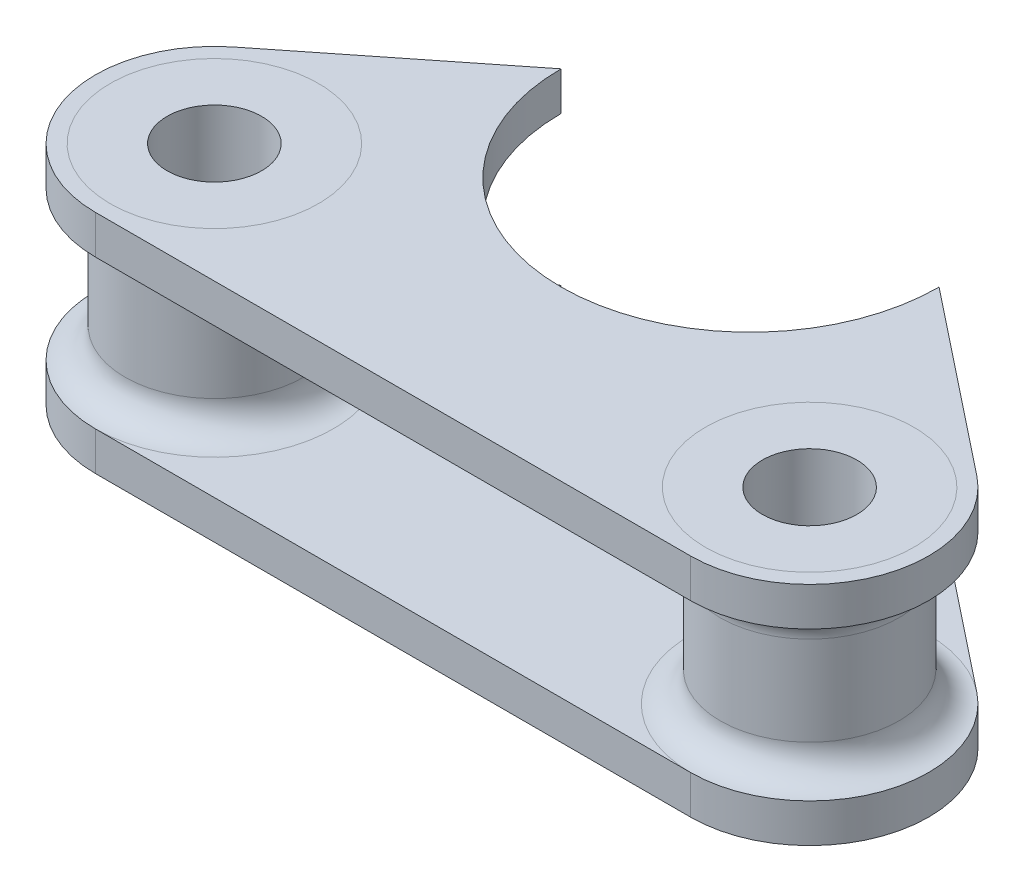
ISO-10303-21;
HEADER;
FILE_DESCRIPTION(('STEP AP214'),'2;1');
FILE_NAME('part.step','',(''),(''),'','','');
FILE_SCHEMA(('AUTOMOTIVE_DESIGN { 1 0 10303 214 1 1 1 1 }'));
ENDSEC;
DATA;
#1=APPLICATION_CONTEXT('core data for automotive mechanical design processes');
#2=APPLICATION_PROTOCOL_DEFINITION('international standard','automotive_design',2000,#1);
#3=PRODUCT_CONTEXT('',#1,'mechanical');
#4=PRODUCT('Part','Part','',(#3));
#5=PRODUCT_RELATED_PRODUCT_CATEGORY('part','',(#4));
#6=PRODUCT_DEFINITION_FORMATION('','',#4);
#7=PRODUCT_DEFINITION_CONTEXT('part definition',#1,'design');
#8=PRODUCT_DEFINITION('design','',#6,#7);
#9=PRODUCT_DEFINITION_SHAPE('','',#8);
#10=(LENGTH_UNIT() NAMED_UNIT(*) SI_UNIT(.MILLI.,.METRE.));
#11=(NAMED_UNIT(*) PLANE_ANGLE_UNIT() SI_UNIT($,.RADIAN.));
#12=(NAMED_UNIT(*) SI_UNIT($,.STERADIAN.) SOLID_ANGLE_UNIT());
#13=UNCERTAINTY_MEASURE_WITH_UNIT(LENGTH_MEASURE(1.E-05),#10,'distance_accuracy_value','');
#14=(GEOMETRIC_REPRESENTATION_CONTEXT(3) GLOBAL_UNCERTAINTY_ASSIGNED_CONTEXT((#13)) GLOBAL_UNIT_ASSIGNED_CONTEXT((#10,
#11,#12)) REPRESENTATION_CONTEXT('',''));
#15=CARTESIAN_POINT('',(0.,0.,0.));
#16=DIRECTION('',(0.,0.,1.));
#17=DIRECTION('',(1.,0.,0.));
#18=AXIS2_PLACEMENT_3D('',#15,#16,#17);
#19=CARTESIAN_POINT('',(0.,-7.6,-16.));
#20=DIRECTION('',(0.,1.,0.));
#21=DIRECTION('',(0.,0.,1.));
#22=AXIS2_PLACEMENT_3D('',#19,#20,#21);
#23=PLANE('',#22);
#24=CARTESIAN_POINT('',(-20.,-7.6,0.));
#25=DIRECTION('',(0.,1.,0.));
#26=DIRECTION('',(0.,0.,1.));
#27=AXIS2_PLACEMENT_3D('',#24,#25,#26);
#28=CIRCLE('',#27,7.);
#29=CARTESIAN_POINT('',(-20.,-7.6,7.));
#30=VERTEX_POINT('',#29);
#31=EDGE_CURVE('E160',#30,#30,#28,.F.);
#32=ORIENTED_EDGE('',*,*,#31,.F.);
#33=EDGE_LOOP('',(#32));
#34=FACE_BOUND('',#33,.T.);
#35=CARTESIAN_POINT('',(0.,-7.6,-16.));
#36=DIRECTION('',(0.,-1.,0.));
#37=DIRECTION('',(0.,0.,1.));
#38=AXIS2_PLACEMENT_3D('',#35,#36,#37);
#39=CIRCLE('',#38,12.7);
#40=CARTESIAN_POINT('',(12.7,-7.6,-16.));
#41=VERTEX_POINT('',#40);
#42=CARTESIAN_POINT('',(-12.7,-7.6,-16.));
#43=VERTEX_POINT('',#42);
#44=EDGE_CURVE('E245',#41,#43,#39,.T.);
#45=ORIENTED_EDGE('',*,*,#44,.F.);
#46=DIRECTION('',(-0.7835063491706,0.,-0.621383779004053));
#47=VECTOR('',#46,1.);
#48=CARTESIAN_POINT('',(12.7,-7.6,-16.));
#49=LINE('',#48,#47);
#50=CARTESIAN_POINT('',(24.9710702320324,-7.6,-6.26805079336479));
#51=VERTEX_POINT('',#50);
#52=EDGE_CURVE('E258',#51,#41,#49,.T.);
#53=ORIENTED_EDGE('',*,*,#52,.F.);
#54=CARTESIAN_POINT('',(20.,-7.6,0.));
#55=DIRECTION('',(0.,1.,0.));
#56=DIRECTION('',(0.,0.,1.));
#57=AXIS2_PLACEMENT_3D('',#54,#55,#56);
#58=CIRCLE('',#57,8.);
#59=CARTESIAN_POINT('',(20.,-7.6,8.));
#60=VERTEX_POINT('',#59);
#61=EDGE_CURVE('E255',#60,#51,#58,.T.);
#62=ORIENTED_EDGE('',*,*,#61,.F.);
#63=DIRECTION('',(1.,0.,0.));
#64=VECTOR('',#63,1.);
#65=CARTESIAN_POINT('',(-20.,-7.6,8.));
#66=LINE('',#65,#64);
#67=CARTESIAN_POINT('',(-20.,-7.6,8.));
#68=VERTEX_POINT('',#67);
#69=EDGE_CURVE('E252',#68,#60,#66,.T.);
#70=ORIENTED_EDGE('',*,*,#69,.F.);
#71=CARTESIAN_POINT('',(-20.,-7.6,0.));
#72=DIRECTION('',(0.,1.,0.));
#73=DIRECTION('',(0.,0.,1.));
#74=AXIS2_PLACEMENT_3D('',#71,#72,#73);
#75=CIRCLE('',#74,8.);
#76=CARTESIAN_POINT('',(-24.9710702320324,-7.6,-6.2680507933648));
#77=VERTEX_POINT('',#76);
#78=EDGE_CURVE('E250',#77,#68,#75,.T.);
#79=ORIENTED_EDGE('',*,*,#78,.F.);
#80=DIRECTION('',(-0.7835063491706,0.,0.621383779004054));
#81=VECTOR('',#80,1.);
#82=CARTESIAN_POINT('',(-12.7,-7.6,-16.));
#83=LINE('',#82,#81);
#84=EDGE_CURVE('E224',#43,#77,#83,.T.);
#85=ORIENTED_EDGE('',*,*,#84,.F.);
#86=EDGE_LOOP('',(#45,#53,#62,#70,#79,#85));
#87=FACE_BOUND('',#86,.T.);
#88=CARTESIAN_POINT('',(20.,-7.6,0.));
#89=DIRECTION('',(0.,1.,0.));
#90=DIRECTION('',(0.,0.,1.));
#91=AXIS2_PLACEMENT_3D('',#88,#89,#90);
#92=CIRCLE('',#91,7.);
#93=CARTESIAN_POINT('',(20.,-7.6,7.));
#94=VERTEX_POINT('',#93);
#95=EDGE_CURVE('E168',#94,#94,#92,.F.);
#96=ORIENTED_EDGE('',*,*,#95,.F.);
#97=EDGE_LOOP('',(#96));
#98=FACE_BOUND('',#97,.T.);
#99=ADVANCED_FACE('F38',(#34,#87,#98),#23,.F.);
#100=CARTESIAN_POINT('',(0.,7.6,-16.));
#101=DIRECTION('',(0.,1.,0.));
#102=DIRECTION('',(0.,0.,1.));
#103=AXIS2_PLACEMENT_3D('',#100,#101,#102);
#104=PLANE('',#103);
#105=CARTESIAN_POINT('',(-20.,7.6,0.));
#106=DIRECTION('',(0.,1.,0.));
#107=DIRECTION('',(0.,0.,1.));
#108=AXIS2_PLACEMENT_3D('',#105,#106,#107);
#109=CIRCLE('',#108,7.);
#110=CARTESIAN_POINT('',(-20.,7.6,7.));
#111=VERTEX_POINT('',#110);
#112=EDGE_CURVE('E154',#111,#111,#109,.F.);
#113=ORIENTED_EDGE('',*,*,#112,.T.);
#114=EDGE_LOOP('',(#113));
#115=FACE_BOUND('',#114,.T.);
#116=CARTESIAN_POINT('',(0.,7.6,-16.));
#117=DIRECTION('',(0.,-1.,0.));
#118=DIRECTION('',(0.,0.,1.));
#119=AXIS2_PLACEMENT_3D('',#116,#117,#118);
#120=CIRCLE('',#119,12.7);
#121=CARTESIAN_POINT('',(12.7,7.6,-16.));
#122=VERTEX_POINT('',#121);
#123=CARTESIAN_POINT('',(-12.7,7.6,-16.));
#124=VERTEX_POINT('',#123);
#125=EDGE_CURVE('E136',#122,#124,#120,.T.);
#126=ORIENTED_EDGE('',*,*,#125,.T.);
#127=DIRECTION('',(-0.7835063491706,0.,0.621383779004054));
#128=VECTOR('',#127,1.);
#129=CARTESIAN_POINT('',(-12.7,7.6,-16.));
#130=LINE('',#129,#128);
#131=CARTESIAN_POINT('',(-24.9710702320324,7.6,-6.2680507933648));
#132=VERTEX_POINT('',#131);
#133=EDGE_CURVE('E139',#124,#132,#130,.T.);
#134=ORIENTED_EDGE('',*,*,#133,.T.);
#135=CARTESIAN_POINT('',(-20.,7.6,0.));
#136=DIRECTION('',(0.,1.,0.));
#137=DIRECTION('',(0.,0.,1.));
#138=AXIS2_PLACEMENT_3D('',#135,#136,#137);
#139=CIRCLE('',#138,8.);
#140=CARTESIAN_POINT('',(-20.,7.6,8.));
#141=VERTEX_POINT('',#140);
#142=EDGE_CURVE('E143',#132,#141,#139,.T.);
#143=ORIENTED_EDGE('',*,*,#142,.T.);
#144=DIRECTION('',(1.,0.,0.));
#145=VECTOR('',#144,1.);
#146=CARTESIAN_POINT('',(-20.,7.6,8.));
#147=LINE('',#146,#145);
#148=CARTESIAN_POINT('',(20.,7.6,8.));
#149=VERTEX_POINT('',#148);
#150=EDGE_CURVE('E146',#141,#149,#147,.T.);
#151=ORIENTED_EDGE('',*,*,#150,.T.);
#152=CARTESIAN_POINT('',(20.,7.6,0.));
#153=DIRECTION('',(0.,1.,0.));
#154=DIRECTION('',(0.,0.,1.));
#155=AXIS2_PLACEMENT_3D('',#152,#153,#154);
#156=CIRCLE('',#155,8.);
#157=CARTESIAN_POINT('',(24.9710702320324,7.6,-6.26805079336479));
#158=VERTEX_POINT('',#157);
#159=EDGE_CURVE('E122',#149,#158,#156,.T.);
#160=ORIENTED_EDGE('',*,*,#159,.T.);
#161=DIRECTION('',(-0.7835063491706,0.,-0.621383779004053));
#162=VECTOR('',#161,1.);
#163=CARTESIAN_POINT('',(12.7,7.6,-16.));
#164=LINE('',#163,#162);
#165=EDGE_CURVE('E149',#158,#122,#164,.T.);
#166=ORIENTED_EDGE('',*,*,#165,.T.);
#167=EDGE_LOOP('',(#126,#134,#143,#151,#160,#166));
#168=FACE_BOUND('',#167,.T.);
#169=CARTESIAN_POINT('',(20.,7.6,0.));
#170=DIRECTION('',(0.,1.,0.));
#171=DIRECTION('',(0.,0.,1.));
#172=AXIS2_PLACEMENT_3D('',#169,#170,#171);
#173=CIRCLE('',#172,7.);
#174=CARTESIAN_POINT('',(20.,7.6,7.));
#175=VERTEX_POINT('',#174);
#176=EDGE_CURVE('E164',#175,#175,#173,.F.);
#177=ORIENTED_EDGE('',*,*,#176,.T.);
#178=EDGE_LOOP('',(#177));
#179=FACE_BOUND('',#178,.T.);
#180=ADVANCED_FACE('F288',(#115,#168,#179),#104,.T.);
#181=ORIENTED_EDGE('',*,*,#95,.T.);
#182=EDGE_LOOP('',(#181));
#183=FACE_BOUND('',#182,.T.);
#184=CARTESIAN_POINT('',(20.,-7.6,0.));
#185=DIRECTION('',(0.,1.,0.));
#186=DIRECTION('',(0.,0.,1.));
#187=AXIS2_PLACEMENT_3D('',#184,#185,#186);
#188=CIRCLE('',#187,3.175);
#189=CARTESIAN_POINT('',(20.,-7.6,3.175));
#190=VERTEX_POINT('',#189);
#191=EDGE_CURVE('E332',#190,#190,#188,.T.);
#192=ORIENTED_EDGE('',*,*,#191,.T.);
#193=EDGE_LOOP('',(#192));
#194=FACE_BOUND('',#193,.T.);
#195=ADVANCED_FACE('F304',(#183,#194),#23,.F.);
#196=ORIENTED_EDGE('',*,*,#176,.F.);
#197=EDGE_LOOP('',(#196));
#198=FACE_BOUND('',#197,.T.);
#199=CARTESIAN_POINT('',(20.,7.6,0.));
#200=DIRECTION('',(0.,1.,0.));
#201=DIRECTION('',(0.,0.,1.));
#202=AXIS2_PLACEMENT_3D('',#199,#200,#201);
#203=CIRCLE('',#202,3.175);
#204=CARTESIAN_POINT('',(20.,7.6,3.175));
#205=VERTEX_POINT('',#204);
#206=EDGE_CURVE('E271',#205,#205,#203,.T.);
#207=ORIENTED_EDGE('',*,*,#206,.F.);
#208=EDGE_LOOP('',(#207));
#209=FACE_BOUND('',#208,.T.);
#210=ADVANCED_FACE('F310',(#198,#209),#104,.T.);
#211=CARTESIAN_POINT('',(-20.,-6.,0.));
#212=DIRECTION('',(0.,1.,0.));
#213=DIRECTION('',(0.,0.,1.));
#214=AXIS2_PLACEMENT_3D('',#211,#212,#213);
#215=CYLINDRICAL_SURFACE('',#214,6.);
#216=CARTESIAN_POINT('',(-20.,3.,0.));
#217=DIRECTION('',(0.,1.,0.));
#218=DIRECTION('',(0.,0.,1.));
#219=AXIS2_PLACEMENT_3D('',#216,#217,#218);
#220=CIRCLE('',#219,6.);
#221=CARTESIAN_POINT('',(-20.,3.,6.));
#222=VERTEX_POINT('',#221);
#223=EDGE_CURVE('E11',#222,#222,#220,.F.);
#224=ORIENTED_EDGE('',*,*,#223,.T.);
#225=EDGE_LOOP('',(#224));
#226=FACE_BOUND('',#225,.T.);
#227=CARTESIAN_POINT('',(-20.,-3.,0.));
#228=DIRECTION('',(0.,1.,0.));
#229=DIRECTION('',(0.,0.,1.));
#230=AXIS2_PLACEMENT_3D('',#227,#228,#229);
#231=CIRCLE('',#230,6.);
#232=CARTESIAN_POINT('',(-20.,-3.,6.));
#233=VERTEX_POINT('',#232);
#234=EDGE_CURVE('E47',#233,#233,#231,.T.);
#235=ORIENTED_EDGE('',*,*,#234,.T.);
#236=EDGE_LOOP('',(#235));
#237=FACE_BOUND('',#236,.T.);
#238=ADVANCED_FACE('F189',(#226,#237),#215,.T.);
#239=CARTESIAN_POINT('',(-20.,-6.,0.));
#240=DIRECTION('',(0.,1.,0.));
#241=DIRECTION('',(0.,0.,1.));
#242=AXIS2_PLACEMENT_3D('',#239,#240,#241);
#243=CYLINDRICAL_SURFACE('',#242,3.175);
#244=CARTESIAN_POINT('',(-20.,7.6,0.));
#245=DIRECTION('',(0.,1.,0.));
#246=DIRECTION('',(0.,0.,1.));
#247=AXIS2_PLACEMENT_3D('',#244,#245,#246);
#248=CIRCLE('',#247,3.175);
#249=CARTESIAN_POINT('',(-20.,7.6,3.175));
#250=VERTEX_POINT('',#249);
#251=EDGE_CURVE('E140',#250,#250,#248,.T.);
#252=ORIENTED_EDGE('',*,*,#251,.T.);
#253=EDGE_LOOP('',(#252));
#254=FACE_BOUND('',#253,.T.);
#255=CARTESIAN_POINT('',(-20.,-7.6,0.));
#256=DIRECTION('',(0.,1.,0.));
#257=DIRECTION('',(0.,0.,1.));
#258=AXIS2_PLACEMENT_3D('',#255,#256,#257);
#259=CIRCLE('',#258,3.175);
#260=CARTESIAN_POINT('',(-20.,-7.6,3.175));
#261=VERTEX_POINT('',#260);
#262=EDGE_CURVE('E248',#261,#261,#259,.T.);
#263=ORIENTED_EDGE('',*,*,#262,.F.);
#264=EDGE_LOOP('',(#263));
#265=FACE_BOUND('',#264,.T.);
#266=ADVANCED_FACE('F298',(#254,#265),#243,.F.);
#267=CARTESIAN_POINT('',(0.,5.,-16.));
#268=DIRECTION('',(0.,1.,0.));
#269=DIRECTION('',(0.,0.,1.));
#270=AXIS2_PLACEMENT_3D('',#267,#268,#269);
#271=CYLINDRICAL_SURFACE('',#270,12.7);
#272=ORIENTED_EDGE('',*,*,#125,.F.);
#273=DIRECTION('',(0.,1.,0.));
#274=VECTOR('',#273,1.);
#275=CARTESIAN_POINT('',(12.7,5.,-16.));
#276=LINE('',#275,#274);
#277=CARTESIAN_POINT('',(12.7,5.,-16.));
#278=VERTEX_POINT('',#277);
#279=EDGE_CURVE('E55',#278,#122,#276,.T.);
#280=ORIENTED_EDGE('',*,*,#279,.F.);
#281=CARTESIAN_POINT('',(0.,5.,-16.));
#282=DIRECTION('',(0.,-1.,0.));
#283=DIRECTION('',(0.,0.,1.));
#284=AXIS2_PLACEMENT_3D('',#281,#282,#283);
#285=CIRCLE('',#284,12.7);
#286=CARTESIAN_POINT('',(-12.7,5.,-16.));
#287=VERTEX_POINT('',#286);
#288=EDGE_CURVE('E152',#278,#287,#285,.T.);
#289=ORIENTED_EDGE('',*,*,#288,.T.);
#290=DIRECTION('',(0.,1.,0.));
#291=VECTOR('',#290,1.);
#292=CARTESIAN_POINT('',(-12.7,5.,-16.));
#293=LINE('',#292,#291);
#294=EDGE_CURVE('E92',#287,#124,#293,.T.);
#295=ORIENTED_EDGE('',*,*,#294,.T.);
#296=EDGE_LOOP('',(#272,#280,#289,#295));
#297=FACE_BOUND('',#296,.T.);
#298=ADVANCED_FACE('F285',(#297),#271,.F.);
#299=CARTESIAN_POINT('',(12.7,5.,-16.));
#300=DIRECTION('',(0.621383779004054,0.,-0.7835063491706));
#301=DIRECTION('',(-0.7835063491706,0.,-0.621383779004054));
#302=AXIS2_PLACEMENT_3D('',#299,#300,#301);
#303=PLANE('',#302);
#304=ORIENTED_EDGE('',*,*,#165,.F.);
#305=DIRECTION('',(0.,1.,0.));
#306=VECTOR('',#305,1.);
#307=CARTESIAN_POINT('',(24.9710702320324,5.,-6.26805079336479));
#308=LINE('',#307,#306);
#309=CARTESIAN_POINT('',(24.9710702320324,5.,-6.26805079336479));
#310=VERTEX_POINT('',#309);
#311=EDGE_CURVE('E80',#310,#158,#308,.T.);
#312=ORIENTED_EDGE('',*,*,#311,.F.);
#313=DIRECTION('',(-0.7835063491706,0.,-0.621383779004053));
#314=VECTOR('',#313,1.);
#315=CARTESIAN_POINT('',(12.7,5.,-16.));
#316=LINE('',#315,#314);
#317=EDGE_CURVE('E113',#310,#278,#316,.T.);
#318=ORIENTED_EDGE('',*,*,#317,.T.);
#319=ORIENTED_EDGE('',*,*,#279,.T.);
#320=EDGE_LOOP('',(#304,#312,#318,#319));
#321=FACE_BOUND('',#320,.T.);
#322=ADVANCED_FACE('F290',(#321),#303,.T.);
#323=CARTESIAN_POINT('',(20.,5.,0.));
#324=DIRECTION('',(0.,1.,0.));
#325=DIRECTION('',(0.,0.,1.));
#326=AXIS2_PLACEMENT_3D('',#323,#324,#325);
#327=CYLINDRICAL_SURFACE('',#326,8.);
#328=ORIENTED_EDGE('',*,*,#159,.F.);
#329=DIRECTION('',(0.,1.,0.));
#330=VECTOR('',#329,1.);
#331=CARTESIAN_POINT('',(20.,5.,8.));
#332=LINE('',#331,#330);
#333=CARTESIAN_POINT('',(20.,5.,8.));
#334=VERTEX_POINT('',#333);
#335=EDGE_CURVE('E119',#334,#149,#332,.T.);
#336=ORIENTED_EDGE('',*,*,#335,.F.);
#337=CARTESIAN_POINT('',(20.,5.,0.));
#338=DIRECTION('',(0.,1.,0.));
#339=DIRECTION('',(0.,0.,1.));
#340=AXIS2_PLACEMENT_3D('',#337,#338,#339);
#341=CIRCLE('',#340,8.);
#342=EDGE_CURVE('E121',#334,#310,#341,.T.);
#343=ORIENTED_EDGE('',*,*,#342,.T.);
#344=ORIENTED_EDGE('',*,*,#311,.T.);
#345=EDGE_LOOP('',(#328,#336,#343,#344));
#346=FACE_BOUND('',#345,.T.);
#347=ADVANCED_FACE('F120',(#346),#327,.T.);
#348=CARTESIAN_POINT('',(-20.,5.,8.));
#349=DIRECTION('',(0.,0.,1.));
#350=DIRECTION('',(1.,0.,0.));
#351=AXIS2_PLACEMENT_3D('',#348,#349,#350);
#352=PLANE('',#351);
#353=ORIENTED_EDGE('',*,*,#150,.F.);
#354=DIRECTION('',(0.,1.,0.));
#355=VECTOR('',#354,1.);
#356=CARTESIAN_POINT('',(-20.,5.,8.));
#357=LINE('',#356,#355);
#358=CARTESIAN_POINT('',(-20.,5.,8.));
#359=VERTEX_POINT('',#358);
#360=EDGE_CURVE('E126',#359,#141,#357,.T.);
#361=ORIENTED_EDGE('',*,*,#360,.F.);
#362=DIRECTION('',(1.,0.,0.));
#363=VECTOR('',#362,1.);
#364=CARTESIAN_POINT('',(-20.,5.,8.));
#365=LINE('',#364,#363);
#366=EDGE_CURVE('E111',#359,#334,#365,.T.);
#367=ORIENTED_EDGE('',*,*,#366,.T.);
#368=ORIENTED_EDGE('',*,*,#335,.T.);
#369=EDGE_LOOP('',(#353,#361,#367,#368));
#370=FACE_BOUND('',#369,.T.);
#371=ADVANCED_FACE('F128',(#370),#352,.T.);
#372=CARTESIAN_POINT('',(-20.,5.,0.));
#373=DIRECTION('',(0.,1.,0.));
#374=DIRECTION('',(0.,0.,1.));
#375=AXIS2_PLACEMENT_3D('',#372,#373,#374);
#376=CYLINDRICAL_SURFACE('',#375,8.);
#377=ORIENTED_EDGE('',*,*,#142,.F.);
#378=DIRECTION('',(0.,1.,0.));
#379=VECTOR('',#378,1.);
#380=CARTESIAN_POINT('',(-24.9710702320324,5.,-6.2680507933648));
#381=LINE('',#380,#379);
#382=CARTESIAN_POINT('',(-24.9710702320324,5.,-6.2680507933648));
#383=VERTEX_POINT('',#382);
#384=EDGE_CURVE('E157',#383,#132,#381,.T.);
#385=ORIENTED_EDGE('',*,*,#384,.F.);
#386=CARTESIAN_POINT('',(-20.,5.,0.));
#387=DIRECTION('',(0.,1.,0.));
#388=DIRECTION('',(0.,0.,1.));
#389=AXIS2_PLACEMENT_3D('',#386,#387,#388);
#390=CIRCLE('',#389,8.);
#391=EDGE_CURVE('E129',#383,#359,#390,.T.);
#392=ORIENTED_EDGE('',*,*,#391,.T.);
#393=ORIENTED_EDGE('',*,*,#360,.T.);
#394=EDGE_LOOP('',(#377,#385,#392,#393));
#395=FACE_BOUND('',#394,.T.);
#396=ADVANCED_FACE('F282',(#395),#376,.T.);
#397=CARTESIAN_POINT('',(-12.7,5.,-16.));
#398=DIRECTION('',(-0.621383779004053,0.,-0.7835063491706));
#399=DIRECTION('',(-0.7835063491706,0.,0.621383779004053));
#400=AXIS2_PLACEMENT_3D('',#397,#398,#399);
#401=PLANE('',#400);
#402=ORIENTED_EDGE('',*,*,#133,.F.);
#403=ORIENTED_EDGE('',*,*,#294,.F.);
#404=DIRECTION('',(-0.7835063491706,0.,0.621383779004054));
#405=VECTOR('',#404,1.);
#406=CARTESIAN_POINT('',(-12.7,5.,-16.));
#407=LINE('',#406,#405);
#408=EDGE_CURVE('E277',#287,#383,#407,.T.);
#409=ORIENTED_EDGE('',*,*,#408,.T.);
#410=ORIENTED_EDGE('',*,*,#384,.T.);
#411=EDGE_LOOP('',(#402,#403,#409,#410));
#412=FACE_BOUND('',#411,.T.);
#413=ADVANCED_FACE('F286',(#412),#401,.T.);
#414=CARTESIAN_POINT('',(0.,5.,-16.));
#415=DIRECTION('',(0.,1.,0.));
#416=DIRECTION('',(0.,0.,1.));
#417=AXIS2_PLACEMENT_3D('',#414,#415,#416);
#418=PLANE('',#417);
#419=ORIENTED_EDGE('',*,*,#317,.F.);
#420=CARTESIAN_POINT('',(20.,5.,0.));
#421=DIRECTION('',(0.,1.,0.));
#422=DIRECTION('',(0.,0.,1.));
#423=AXIS2_PLACEMENT_3D('',#420,#421,#422);
#424=CIRCLE('',#423,8.);
#425=EDGE_CURVE('E106',#310,#334,#424,.T.);
#426=ORIENTED_EDGE('',*,*,#425,.T.);
#427=ORIENTED_EDGE('',*,*,#366,.F.);
#428=CARTESIAN_POINT('',(-20.,5.,0.));
#429=DIRECTION('',(0.,1.,0.));
#430=DIRECTION('',(0.,0.,1.));
#431=AXIS2_PLACEMENT_3D('',#428,#429,#430);
#432=CIRCLE('',#431,8.);
#433=EDGE_CURVE('E117',#359,#383,#432,.T.);
#434=ORIENTED_EDGE('',*,*,#433,.T.);
#435=ORIENTED_EDGE('',*,*,#408,.F.);
#436=ORIENTED_EDGE('',*,*,#288,.F.);
#437=EDGE_LOOP('',(#419,#426,#427,#434,#435,#436));
#438=FACE_BOUND('',#437,.T.);
#439=ADVANCED_FACE('F108',(#438),#418,.F.);
#440=ORIENTED_EDGE('',*,*,#112,.F.);
#441=EDGE_LOOP('',(#440));
#442=FACE_BOUND('',#441,.T.);
#443=ORIENTED_EDGE('',*,*,#251,.F.);
#444=EDGE_LOOP('',(#443));
#445=FACE_BOUND('',#444,.T.);
#446=ADVANCED_FACE('F311',(#442,#445),#104,.T.);
#447=CARTESIAN_POINT('',(20.,5.,0.));
#448=DIRECTION('',(0.,1.,0.));
#449=DIRECTION('',(0.,0.,1.));
#450=AXIS2_PLACEMENT_3D('',#447,#448,#449);
#451=CYLINDRICAL_SURFACE('',#450,3.175);
#452=ORIENTED_EDGE('',*,*,#206,.T.);
#453=EDGE_LOOP('',(#452));
#454=FACE_BOUND('',#453,.T.);
#455=ORIENTED_EDGE('',*,*,#191,.F.);
#456=EDGE_LOOP('',(#455));
#457=FACE_BOUND('',#456,.T.);
#458=ADVANCED_FACE('F339',(#454,#457),#451,.F.);
#459=CARTESIAN_POINT('',(20.,-6.,0.));
#460=DIRECTION('',(0.,1.,0.));
#461=DIRECTION('',(0.,0.,1.));
#462=AXIS2_PLACEMENT_3D('',#459,#460,#461);
#463=CYLINDRICAL_SURFACE('',#462,6.);
#464=CARTESIAN_POINT('',(20.,3.,0.));
#465=DIRECTION('',(0.,1.,0.));
#466=DIRECTION('',(0.,0.,1.));
#467=AXIS2_PLACEMENT_3D('',#464,#465,#466);
#468=CIRCLE('',#467,6.);
#469=CARTESIAN_POINT('',(20.,3.,6.));
#470=VERTEX_POINT('',#469);
#471=EDGE_CURVE('E178',#470,#470,#468,.F.);
#472=ORIENTED_EDGE('',*,*,#471,.T.);
#473=EDGE_LOOP('',(#472));
#474=FACE_BOUND('',#473,.T.);
#475=CARTESIAN_POINT('',(20.,-3.,0.));
#476=DIRECTION('',(0.,1.,0.));
#477=DIRECTION('',(0.,0.,1.));
#478=AXIS2_PLACEMENT_3D('',#475,#476,#477);
#479=CIRCLE('',#478,6.);
#480=CARTESIAN_POINT('',(20.,-3.,6.));
#481=VERTEX_POINT('',#480);
#482=EDGE_CURVE('E116',#481,#481,#479,.T.);
#483=ORIENTED_EDGE('',*,*,#482,.T.);
#484=EDGE_LOOP('',(#483));
#485=FACE_BOUND('',#484,.T.);
#486=ADVANCED_FACE('F327',(#474,#485),#463,.T.);
#487=CARTESIAN_POINT('',(0.,-5.,-16.));
#488=DIRECTION('',(0.,1.,0.));
#489=DIRECTION('',(0.,0.,1.));
#490=AXIS2_PLACEMENT_3D('',#487,#488,#489);
#491=PLANE('',#490);
#492=DIRECTION('',(1.,0.,0.));
#493=VECTOR('',#492,1.);
#494=CARTESIAN_POINT('',(-20.,-5.,8.));
#495=LINE('',#494,#493);
#496=CARTESIAN_POINT('',(-20.,-5.,8.));
#497=VERTEX_POINT('',#496);
#498=CARTESIAN_POINT('',(20.,-5.,8.));
#499=VERTEX_POINT('',#498);
#500=EDGE_CURVE('E234',#497,#499,#495,.T.);
#501=ORIENTED_EDGE('',*,*,#500,.T.);
#502=CARTESIAN_POINT('',(20.,-5.,0.));
#503=DIRECTION('',(0.,1.,0.));
#504=DIRECTION('',(0.,0.,1.));
#505=AXIS2_PLACEMENT_3D('',#502,#503,#504);
#506=CIRCLE('',#505,8.);
#507=CARTESIAN_POINT('',(24.9710702320324,-5.,-6.26805079336479));
#508=VERTEX_POINT('',#507);
#509=EDGE_CURVE('E184',#499,#508,#506,.F.);
#510=ORIENTED_EDGE('',*,*,#509,.T.);
#511=DIRECTION('',(-0.7835063491706,0.,-0.621383779004053));
#512=VECTOR('',#511,1.);
#513=CARTESIAN_POINT('',(12.7,-5.,-16.));
#514=LINE('',#513,#512);
#515=CARTESIAN_POINT('',(12.7,-5.,-16.));
#516=VERTEX_POINT('',#515);
#517=EDGE_CURVE('E242',#508,#516,#514,.T.);
#518=ORIENTED_EDGE('',*,*,#517,.T.);
#519=CARTESIAN_POINT('',(0.,-5.,-16.));
#520=DIRECTION('',(0.,-1.,0.));
#521=DIRECTION('',(0.,0.,1.));
#522=AXIS2_PLACEMENT_3D('',#519,#520,#521);
#523=CIRCLE('',#522,12.7);
#524=CARTESIAN_POINT('',(-12.7,-5.,-16.));
#525=VERTEX_POINT('',#524);
#526=EDGE_CURVE('E213',#516,#525,#523,.T.);
#527=ORIENTED_EDGE('',*,*,#526,.T.);
#528=DIRECTION('',(-0.7835063491706,0.,0.621383779004054));
#529=VECTOR('',#528,1.);
#530=CARTESIAN_POINT('',(-12.7,-5.,-16.));
#531=LINE('',#530,#529);
#532=CARTESIAN_POINT('',(-24.9710702320324,-5.,-6.2680507933648));
#533=VERTEX_POINT('',#532);
#534=EDGE_CURVE('E208',#525,#533,#531,.T.);
#535=ORIENTED_EDGE('',*,*,#534,.T.);
#536=CARTESIAN_POINT('',(-20.,-5.,0.));
#537=DIRECTION('',(0.,1.,0.));
#538=DIRECTION('',(0.,0.,1.));
#539=AXIS2_PLACEMENT_3D('',#536,#537,#538);
#540=CIRCLE('',#539,8.);
#541=EDGE_CURVE('E181',#533,#497,#540,.F.);
#542=ORIENTED_EDGE('',*,*,#541,.T.);
#543=EDGE_LOOP('',(#501,#510,#518,#527,#535,#542));
#544=FACE_BOUND('',#543,.T.);
#545=ADVANCED_FACE('F210',(#544),#491,.T.);
#546=ORIENTED_EDGE('',*,*,#31,.T.);
#547=EDGE_LOOP('',(#546));
#548=FACE_BOUND('',#547,.T.);
#549=ORIENTED_EDGE('',*,*,#262,.T.);
#550=EDGE_LOOP('',(#549));
#551=FACE_BOUND('',#550,.T.);
#552=ADVANCED_FACE('F305',(#548,#551),#23,.F.);
#553=CARTESIAN_POINT('',(0.,-5.,-16.));
#554=DIRECTION('',(0.,-1.,0.));
#555=DIRECTION('',(0.,0.,-1.));
#556=AXIS2_PLACEMENT_3D('',#553,#554,#555);
#557=CYLINDRICAL_SURFACE('',#556,12.7);
#558=ORIENTED_EDGE('',*,*,#44,.T.);
#559=DIRECTION('',(0.,-1.,0.));
#560=VECTOR('',#559,1.);
#561=CARTESIAN_POINT('',(-12.7,-5.,-16.));
#562=LINE('',#561,#560);
#563=EDGE_CURVE('E228',#525,#43,#562,.T.);
#564=ORIENTED_EDGE('',*,*,#563,.F.);
#565=ORIENTED_EDGE('',*,*,#526,.F.);
#566=DIRECTION('',(0.,-1.,0.));
#567=VECTOR('',#566,1.);
#568=CARTESIAN_POINT('',(12.7,-5.,-16.));
#569=LINE('',#568,#567);
#570=EDGE_CURVE('E244',#516,#41,#569,.T.);
#571=ORIENTED_EDGE('',*,*,#570,.T.);
#572=EDGE_LOOP('',(#558,#564,#565,#571));
#573=FACE_BOUND('',#572,.T.);
#574=ADVANCED_FACE('F319',(#573),#557,.F.);
#575=CARTESIAN_POINT('',(-12.7,-5.,-16.));
#576=DIRECTION('',(0.621383779004053,0.,0.7835063491706));
#577=DIRECTION('',(0.7835063491706,0.,-0.621383779004053));
#578=AXIS2_PLACEMENT_3D('',#575,#576,#577);
#579=PLANE('',#578);
#580=ORIENTED_EDGE('',*,*,#84,.T.);
#581=DIRECTION('',(0.,-1.,0.));
#582=VECTOR('',#581,1.);
#583=CARTESIAN_POINT('',(-24.9710702320324,-5.,-6.2680507933648));
#584=LINE('',#583,#582);
#585=EDGE_CURVE('E220',#533,#77,#584,.T.);
#586=ORIENTED_EDGE('',*,*,#585,.F.);
#587=ORIENTED_EDGE('',*,*,#534,.F.);
#588=ORIENTED_EDGE('',*,*,#563,.T.);
#589=EDGE_LOOP('',(#580,#586,#587,#588));
#590=FACE_BOUND('',#589,.T.);
#591=ADVANCED_FACE('F221',(#590),#579,.F.);
#592=CARTESIAN_POINT('',(-20.,-5.,0.));
#593=DIRECTION('',(0.,-1.,0.));
#594=DIRECTION('',(0.,0.,-1.));
#595=AXIS2_PLACEMENT_3D('',#592,#593,#594);
#596=CYLINDRICAL_SURFACE('',#595,8.);
#597=ORIENTED_EDGE('',*,*,#78,.T.);
#598=DIRECTION('',(0.,-1.,0.));
#599=VECTOR('',#598,1.);
#600=CARTESIAN_POINT('',(-20.,-5.,8.));
#601=LINE('',#600,#599);
#602=EDGE_CURVE('E229',#497,#68,#601,.T.);
#603=ORIENTED_EDGE('',*,*,#602,.F.);
#604=CARTESIAN_POINT('',(-20.,-5.,0.));
#605=DIRECTION('',(0.,1.,0.));
#606=DIRECTION('',(0.,0.,1.));
#607=AXIS2_PLACEMENT_3D('',#604,#605,#606);
#608=CIRCLE('',#607,8.);
#609=EDGE_CURVE('E200',#533,#497,#608,.T.);
#610=ORIENTED_EDGE('',*,*,#609,.F.);
#611=ORIENTED_EDGE('',*,*,#585,.T.);
#612=EDGE_LOOP('',(#597,#603,#610,#611));
#613=FACE_BOUND('',#612,.T.);
#614=ADVANCED_FACE('F231',(#613),#596,.T.);
#615=CARTESIAN_POINT('',(-20.,-5.,8.));
#616=DIRECTION('',(0.,0.,-1.));
#617=DIRECTION('',(-1.,0.,0.));
#618=AXIS2_PLACEMENT_3D('',#615,#616,#617);
#619=PLANE('',#618);
#620=ORIENTED_EDGE('',*,*,#69,.T.);
#621=DIRECTION('',(0.,-1.,0.));
#622=VECTOR('',#621,1.);
#623=CARTESIAN_POINT('',(20.,-5.,8.));
#624=LINE('',#623,#622);
#625=EDGE_CURVE('E266',#499,#60,#624,.T.);
#626=ORIENTED_EDGE('',*,*,#625,.F.);
#627=ORIENTED_EDGE('',*,*,#500,.F.);
#628=ORIENTED_EDGE('',*,*,#602,.T.);
#629=EDGE_LOOP('',(#620,#626,#627,#628));
#630=FACE_BOUND('',#629,.T.);
#631=ADVANCED_FACE('F480',(#630),#619,.F.);
#632=CARTESIAN_POINT('',(20.,-5.,0.));
#633=DIRECTION('',(0.,-1.,0.));
#634=DIRECTION('',(0.,0.,-1.));
#635=AXIS2_PLACEMENT_3D('',#632,#633,#634);
#636=CYLINDRICAL_SURFACE('',#635,8.);
#637=ORIENTED_EDGE('',*,*,#61,.T.);
#638=DIRECTION('',(0.,-1.,0.));
#639=VECTOR('',#638,1.);
#640=CARTESIAN_POINT('',(24.9710702320324,-5.,-6.26805079336479));
#641=LINE('',#640,#639);
#642=EDGE_CURVE('E263',#508,#51,#641,.T.);
#643=ORIENTED_EDGE('',*,*,#642,.F.);
#644=CARTESIAN_POINT('',(20.,-5.,0.));
#645=DIRECTION('',(0.,1.,0.));
#646=DIRECTION('',(0.,0.,1.));
#647=AXIS2_PLACEMENT_3D('',#644,#645,#646);
#648=CIRCLE('',#647,8.);
#649=EDGE_CURVE('E236',#499,#508,#648,.T.);
#650=ORIENTED_EDGE('',*,*,#649,.F.);
#651=ORIENTED_EDGE('',*,*,#625,.T.);
#652=EDGE_LOOP('',(#637,#643,#650,#651));
#653=FACE_BOUND('',#652,.T.);
#654=ADVANCED_FACE('F489',(#653),#636,.T.);
#655=CARTESIAN_POINT('',(12.7,-5.,-16.));
#656=DIRECTION('',(-0.621383779004054,0.,0.7835063491706));
#657=DIRECTION('',(0.7835063491706,0.,0.621383779004054));
#658=AXIS2_PLACEMENT_3D('',#655,#656,#657);
#659=PLANE('',#658);
#660=ORIENTED_EDGE('',*,*,#52,.T.);
#661=ORIENTED_EDGE('',*,*,#570,.F.);
#662=ORIENTED_EDGE('',*,*,#517,.F.);
#663=ORIENTED_EDGE('',*,*,#642,.T.);
#664=EDGE_LOOP('',(#660,#661,#662,#663));
#665=FACE_BOUND('',#664,.T.);
#666=ADVANCED_FACE('F371',(#665),#659,.F.);
#667=CARTESIAN_POINT('',(20.,3.,0.));
#668=DIRECTION('',(0.,1.,0.));
#669=DIRECTION('',(0.,0.,1.));
#670=AXIS2_PLACEMENT_3D('',#667,#668,#669);
#671=TOROIDAL_SURFACE('',#670,8.,2.);
#672=ORIENTED_EDGE('',*,*,#471,.F.);
#673=EDGE_LOOP('',(#672));
#674=FACE_BOUND('',#673,.T.);
#675=ORIENTED_EDGE('',*,*,#425,.F.);
#676=ORIENTED_EDGE('',*,*,#342,.F.);
#677=EDGE_LOOP('',(#675,#676));
#678=FACE_BOUND('',#677,.T.);
#679=ADVANCED_FACE('F131',(#674,#678),#671,.F.);
#680=CARTESIAN_POINT('',(20.,-3.,0.));
#681=DIRECTION('',(0.,1.,0.));
#682=DIRECTION('',(0.,0.,1.));
#683=AXIS2_PLACEMENT_3D('',#680,#681,#682);
#684=TOROIDAL_SURFACE('',#683,8.,2.);
#685=ORIENTED_EDGE('',*,*,#482,.F.);
#686=EDGE_LOOP('',(#685));
#687=FACE_BOUND('',#686,.T.);
#688=ORIENTED_EDGE('',*,*,#649,.T.);
#689=ORIENTED_EDGE('',*,*,#509,.F.);
#690=EDGE_LOOP('',(#688,#689));
#691=FACE_BOUND('',#690,.T.);
#692=ADVANCED_FACE('F370',(#687,#691),#684,.F.);
#693=CARTESIAN_POINT('',(-20.,3.,0.));
#694=DIRECTION('',(0.,1.,0.));
#695=DIRECTION('',(0.,0.,1.));
#696=AXIS2_PLACEMENT_3D('',#693,#694,#695);
#697=TOROIDAL_SURFACE('',#696,8.,2.);
#698=ORIENTED_EDGE('',*,*,#391,.F.);
#699=ORIENTED_EDGE('',*,*,#433,.F.);
#700=EDGE_LOOP('',(#698,#699));
#701=FACE_BOUND('',#700,.T.);
#702=ORIENTED_EDGE('',*,*,#223,.F.);
#703=EDGE_LOOP('',(#702));
#704=FACE_BOUND('',#703,.T.);
#705=ADVANCED_FACE('F193',(#701,#704),#697,.F.);
#706=CARTESIAN_POINT('',(-20.,-3.,0.));
#707=DIRECTION('',(0.,1.,0.));
#708=DIRECTION('',(0.,0.,1.));
#709=AXIS2_PLACEMENT_3D('',#706,#707,#708);
#710=TOROIDAL_SURFACE('',#709,8.,2.);
#711=ORIENTED_EDGE('',*,*,#234,.F.);
#712=EDGE_LOOP('',(#711));
#713=FACE_BOUND('',#712,.T.);
#714=ORIENTED_EDGE('',*,*,#541,.F.);
#715=ORIENTED_EDGE('',*,*,#609,.T.);
#716=EDGE_LOOP('',(#714,#715));
#717=FACE_BOUND('',#716,.T.);
#718=ADVANCED_FACE('F40',(#713,#717),#710,.F.);
#719=CLOSED_SHELL('',(#99,#180,#195,#210,#238,#266,#298,#322,#347,#371,#396,#413,#439,#446,#458,
#486,#545,#552,#574,#591,#614,#631,#654,#666,#679,#692,#705,#718));
#720=MANIFOLD_SOLID_BREP('B2',#719);
#721=ADVANCED_BREP_SHAPE_REPRESENTATION('',(#18,#720),#14);
#722=SHAPE_DEFINITION_REPRESENTATION(#9,#721);
ENDSEC;
END-ISO-10303-21;
